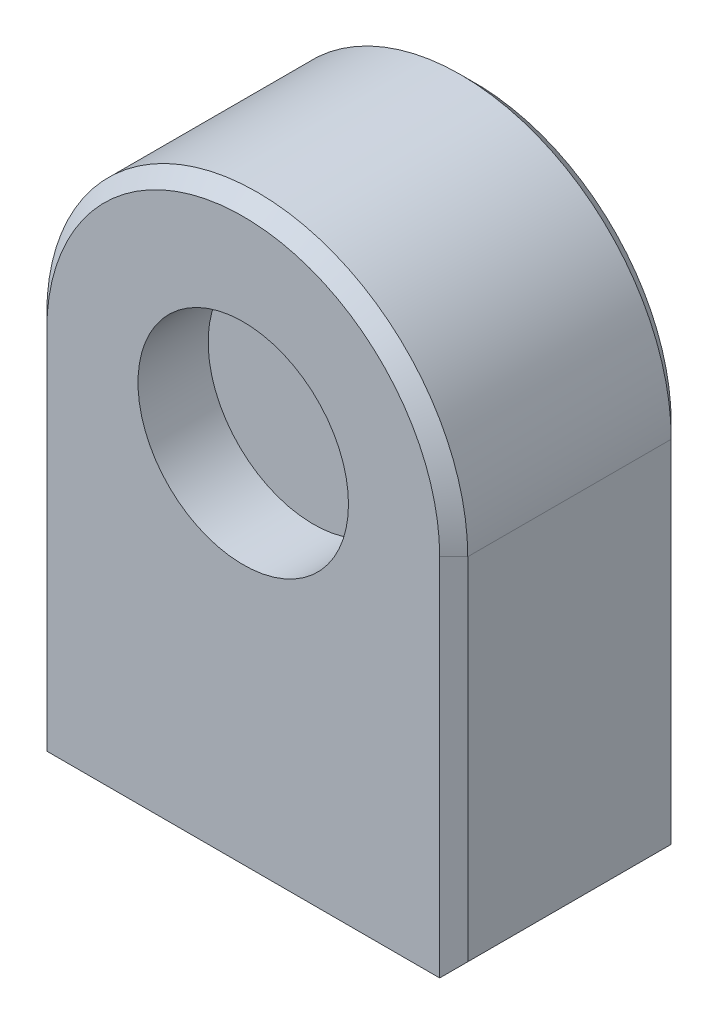
ISO-10303-21;
HEADER;
FILE_DESCRIPTION(('STEP AP214'),'2;1');
FILE_NAME('part.step','',(''),(''),'','','');
FILE_SCHEMA(('AUTOMOTIVE_DESIGN { 1 0 10303 214 1 1 1 1 }'));
ENDSEC;
DATA;
#1=APPLICATION_CONTEXT('core data for automotive mechanical design processes');
#2=APPLICATION_PROTOCOL_DEFINITION('international standard','automotive_design',2000,#1);
#3=PRODUCT_CONTEXT('',#1,'mechanical');
#4=PRODUCT('Part','Part','',(#3));
#5=PRODUCT_RELATED_PRODUCT_CATEGORY('part','',(#4));
#6=PRODUCT_DEFINITION_FORMATION('','',#4);
#7=PRODUCT_DEFINITION_CONTEXT('part definition',#1,'design');
#8=PRODUCT_DEFINITION('design','',#6,#7);
#9=PRODUCT_DEFINITION_SHAPE('','',#8);
#10=(LENGTH_UNIT() NAMED_UNIT(*) SI_UNIT(.MILLI.,.METRE.));
#11=(NAMED_UNIT(*) PLANE_ANGLE_UNIT() SI_UNIT($,.RADIAN.));
#12=(NAMED_UNIT(*) SI_UNIT($,.STERADIAN.) SOLID_ANGLE_UNIT());
#13=UNCERTAINTY_MEASURE_WITH_UNIT(LENGTH_MEASURE(1.E-05),#10,'distance_accuracy_value','');
#14=(GEOMETRIC_REPRESENTATION_CONTEXT(3) GLOBAL_UNCERTAINTY_ASSIGNED_CONTEXT((#13)) GLOBAL_UNIT_ASSIGNED_CONTEXT((#10,
#11,#12)) REPRESENTATION_CONTEXT('',''));
#15=CARTESIAN_POINT('',(0.,0.,0.));
#16=DIRECTION('',(0.,0.,1.));
#17=DIRECTION('',(1.,0.,0.));
#18=AXIS2_PLACEMENT_3D('',#15,#16,#17);
#19=CARTESIAN_POINT('',(0.,0.,16.5));
#20=DIRECTION('',(0.,0.,-1.));
#21=DIRECTION('',(-1.,0.,0.));
#22=AXIS2_PLACEMENT_3D('',#19,#20,#21);
#23=CYLINDRICAL_SURFACE('',#22,15.);
#24=DIRECTION('',(0.,0.,-1.));
#25=VECTOR('',#24,1.);
#26=CARTESIAN_POINT('',(-15.,0.,16.5));
#27=LINE('',#26,#25);
#28=CARTESIAN_POINT('',(-15.,0.,15.5));
#29=VERTEX_POINT('',#28);
#30=CARTESIAN_POINT('',(-15.,0.,1.));
#31=VERTEX_POINT('',#30);
#32=EDGE_CURVE('E115',#29,#31,#27,.T.);
#33=ORIENTED_EDGE('',*,*,#32,.F.);
#34=CARTESIAN_POINT('',(0.,0.,15.5));
#35=DIRECTION('',(0.,0.,-1.));
#36=DIRECTION('',(-1.,0.,0.));
#37=AXIS2_PLACEMENT_3D('',#34,#35,#36);
#38=CIRCLE('',#37,15.);
#39=CARTESIAN_POINT('',(15.,0.,15.5));
#40=VERTEX_POINT('',#39);
#41=EDGE_CURVE('E173',#29,#40,#38,.T.);
#42=ORIENTED_EDGE('',*,*,#41,.T.);
#43=DIRECTION('',(0.,0.,-1.));
#44=VECTOR('',#43,1.);
#45=CARTESIAN_POINT('',(15.,0.,16.5));
#46=LINE('',#45,#44);
#47=CARTESIAN_POINT('',(15.,0.,1.));
#48=VERTEX_POINT('',#47);
#49=EDGE_CURVE('E123',#40,#48,#46,.T.);
#50=ORIENTED_EDGE('',*,*,#49,.T.);
#51=CARTESIAN_POINT('',(0.,0.,1.));
#52=DIRECTION('',(0.,0.,-1.));
#53=DIRECTION('',(-1.,0.,0.));
#54=AXIS2_PLACEMENT_3D('',#51,#52,#53);
#55=CIRCLE('',#54,15.);
#56=EDGE_CURVE('E171',#48,#31,#55,.F.);
#57=ORIENTED_EDGE('',*,*,#56,.T.);
#58=EDGE_LOOP('',(#33,#42,#50,#57));
#59=FACE_BOUND('',#58,.T.);
#60=ADVANCED_FACE('F37',(#59),#23,.T.);
#61=CARTESIAN_POINT('',(-15.,0.,16.5));
#62=DIRECTION('',(1.,0.,0.));
#63=DIRECTION('',(0.,1.,0.));
#64=AXIS2_PLACEMENT_3D('',#61,#62,#63);
#65=PLANE('',#64);
#66=DIRECTION('',(0.,0.,1.));
#67=VECTOR('',#66,1.);
#68=CARTESIAN_POINT('',(-15.,-25.,16.5));
#69=LINE('',#68,#67);
#70=CARTESIAN_POINT('',(-15.,-25.,1.));
#71=VERTEX_POINT('',#70);
#72=CARTESIAN_POINT('',(-15.,-25.,15.5));
#73=VERTEX_POINT('',#72);
#74=EDGE_CURVE('E54',#71,#73,#69,.T.);
#75=ORIENTED_EDGE('',*,*,#74,.T.);
#76=DIRECTION('',(0.,1.,0.));
#77=VECTOR('',#76,1.);
#78=CARTESIAN_POINT('',(-15.,0.,15.5));
#79=LINE('',#78,#77);
#80=EDGE_CURVE('E133',#73,#29,#79,.T.);
#81=ORIENTED_EDGE('',*,*,#80,.T.);
#82=ORIENTED_EDGE('',*,*,#32,.T.);
#83=DIRECTION('',(0.,-1.,0.));
#84=VECTOR('',#83,1.);
#85=CARTESIAN_POINT('',(-15.,-26.,1.));
#86=LINE('',#85,#84);
#87=EDGE_CURVE('E59',#31,#71,#86,.T.);
#88=ORIENTED_EDGE('',*,*,#87,.T.);
#89=EDGE_LOOP('',(#75,#81,#82,#88));
#90=FACE_BOUND('',#89,.T.);
#91=ADVANCED_FACE('F205',(#90),#65,.F.);
#92=CARTESIAN_POINT('',(-15.,-26.,16.5));
#93=DIRECTION('',(0.,1.,0.));
#94=DIRECTION('',(0.,0.,1.));
#95=AXIS2_PLACEMENT_3D('',#92,#93,#94);
#96=PLANE('',#95);
#97=DIRECTION('',(1.,0.,0.));
#98=VECTOR('',#97,1.);
#99=CARTESIAN_POINT('',(-15.,-26.,16.5));
#100=LINE('',#99,#98);
#101=CARTESIAN_POINT('',(-14.,-26.,16.5));
#102=VERTEX_POINT('',#101);
#103=CARTESIAN_POINT('',(14.,-26.,16.5));
#104=VERTEX_POINT('',#103);
#105=EDGE_CURVE('E107',#102,#104,#100,.T.);
#106=ORIENTED_EDGE('',*,*,#105,.F.);
#107=DIRECTION('',(0.,0.,-1.));
#108=VECTOR('',#107,1.);
#109=CARTESIAN_POINT('',(-14.,-26.,16.5));
#110=LINE('',#109,#108);
#111=CARTESIAN_POINT('',(-14.,-26.,0.));
#112=VERTEX_POINT('',#111);
#113=EDGE_CURVE('E11',#102,#112,#110,.T.);
#114=ORIENTED_EDGE('',*,*,#113,.T.);
#115=DIRECTION('',(1.,0.,0.));
#116=VECTOR('',#115,1.);
#117=CARTESIAN_POINT('',(-15.,-26.,0.));
#118=LINE('',#117,#116);
#119=CARTESIAN_POINT('',(14.,-26.,0.));
#120=VERTEX_POINT('',#119);
#121=EDGE_CURVE('E124',#112,#120,#118,.T.);
#122=ORIENTED_EDGE('',*,*,#121,.T.);
#123=DIRECTION('',(0.,0.,1.));
#124=VECTOR('',#123,1.);
#125=CARTESIAN_POINT('',(14.,-26.,16.5));
#126=LINE('',#125,#124);
#127=EDGE_CURVE('E46',#120,#104,#126,.T.);
#128=ORIENTED_EDGE('',*,*,#127,.T.);
#129=EDGE_LOOP('',(#106,#114,#122,#128));
#130=FACE_BOUND('',#129,.T.);
#131=ADVANCED_FACE('F119',(#130),#96,.F.);
#132=CARTESIAN_POINT('',(15.,0.,16.5));
#133=DIRECTION('',(-1.,0.,0.));
#134=DIRECTION('',(0.,-1.,0.));
#135=AXIS2_PLACEMENT_3D('',#132,#133,#134);
#136=PLANE('',#135);
#137=ORIENTED_EDGE('',*,*,#49,.F.);
#138=DIRECTION('',(0.,-1.,0.));
#139=VECTOR('',#138,1.);
#140=CARTESIAN_POINT('',(15.,0.,15.5));
#141=LINE('',#140,#139);
#142=CARTESIAN_POINT('',(15.,-25.,15.5));
#143=VERTEX_POINT('',#142);
#144=EDGE_CURVE('E162',#40,#143,#141,.T.);
#145=ORIENTED_EDGE('',*,*,#144,.T.);
#146=DIRECTION('',(0.,0.,-1.));
#147=VECTOR('',#146,1.);
#148=CARTESIAN_POINT('',(15.,-25.,16.5));
#149=LINE('',#148,#147);
#150=CARTESIAN_POINT('',(15.,-25.,1.));
#151=VERTEX_POINT('',#150);
#152=EDGE_CURVE('E158',#143,#151,#149,.T.);
#153=ORIENTED_EDGE('',*,*,#152,.T.);
#154=DIRECTION('',(0.,1.,0.));
#155=VECTOR('',#154,1.);
#156=CARTESIAN_POINT('',(15.,0.,1.));
#157=LINE('',#156,#155);
#158=EDGE_CURVE('E160',#151,#48,#157,.T.);
#159=ORIENTED_EDGE('',*,*,#158,.T.);
#160=EDGE_LOOP('',(#137,#145,#153,#159));
#161=FACE_BOUND('',#160,.T.);
#162=ADVANCED_FACE('F192',(#161),#136,.F.);
#163=CARTESIAN_POINT('',(0.,0.,16.5));
#164=DIRECTION('',(0.,0.,-1.));
#165=DIRECTION('',(-1.,0.,0.));
#166=AXIS2_PLACEMENT_3D('',#163,#164,#165);
#167=PLANE('',#166);
#168=CARTESIAN_POINT('',(0.,0.,16.5));
#169=DIRECTION('',(0.,0.,1.));
#170=DIRECTION('',(1.,0.,0.));
#171=AXIS2_PLACEMENT_3D('',#168,#169,#170);
#172=CIRCLE('',#171,7.5);
#173=CARTESIAN_POINT('',(7.5,0.,16.5));
#174=VERTEX_POINT('',#173);
#175=EDGE_CURVE('E343',#174,#174,#172,.T.);
#176=ORIENTED_EDGE('',*,*,#175,.F.);
#177=EDGE_LOOP('',(#176));
#178=FACE_BOUND('',#177,.T.);
#179=ORIENTED_EDGE('',*,*,#105,.T.);
#180=DIRECTION('',(0.,1.,0.));
#181=VECTOR('',#180,1.);
#182=CARTESIAN_POINT('',(14.,0.,16.5));
#183=LINE('',#182,#181);
#184=CARTESIAN_POINT('',(14.,0.,16.5));
#185=VERTEX_POINT('',#184);
#186=EDGE_CURVE('E156',#104,#185,#183,.T.);
#187=ORIENTED_EDGE('',*,*,#186,.T.);
#188=CARTESIAN_POINT('',(0.,0.,16.5));
#189=DIRECTION('',(0.,0.,-1.));
#190=DIRECTION('',(-1.,0.,0.));
#191=AXIS2_PLACEMENT_3D('',#188,#189,#190);
#192=CIRCLE('',#191,14.);
#193=CARTESIAN_POINT('',(-14.,0.,16.5));
#194=VERTEX_POINT('',#193);
#195=EDGE_CURVE('E110',#185,#194,#192,.F.);
#196=ORIENTED_EDGE('',*,*,#195,.T.);
#197=DIRECTION('',(0.,-1.,0.));
#198=VECTOR('',#197,1.);
#199=CARTESIAN_POINT('',(-14.,0.,16.5));
#200=LINE('',#199,#198);
#201=EDGE_CURVE('E103',#194,#102,#200,.T.);
#202=ORIENTED_EDGE('',*,*,#201,.T.);
#203=EDGE_LOOP('',(#179,#187,#196,#202));
#204=FACE_BOUND('',#203,.T.);
#205=ADVANCED_FACE('F105',(#178,#204),#167,.F.);
#206=CARTESIAN_POINT('',(0.,0.,0.));
#207=DIRECTION('',(0.,0.,-1.));
#208=DIRECTION('',(-1.,0.,0.));
#209=AXIS2_PLACEMENT_3D('',#206,#207,#208);
#210=PLANE('',#209);
#211=CARTESIAN_POINT('',(0.,0.,0.));
#212=DIRECTION('',(0.,0.,-1.));
#213=DIRECTION('',(-1.,0.,0.));
#214=AXIS2_PLACEMENT_3D('',#211,#212,#213);
#215=CIRCLE('',#214,14.);
#216=CARTESIAN_POINT('',(-14.,0.,0.));
#217=VERTEX_POINT('',#216);
#218=CARTESIAN_POINT('',(14.,0.,0.));
#219=VERTEX_POINT('',#218);
#220=EDGE_CURVE('E167',#217,#219,#215,.T.);
#221=ORIENTED_EDGE('',*,*,#220,.T.);
#222=DIRECTION('',(0.,-1.,0.));
#223=VECTOR('',#222,1.);
#224=CARTESIAN_POINT('',(14.,-26.,0.));
#225=LINE('',#224,#223);
#226=EDGE_CURVE('E169',#219,#120,#225,.T.);
#227=ORIENTED_EDGE('',*,*,#226,.T.);
#228=ORIENTED_EDGE('',*,*,#121,.F.);
#229=DIRECTION('',(0.,1.,0.));
#230=VECTOR('',#229,1.);
#231=CARTESIAN_POINT('',(-14.,0.,0.));
#232=LINE('',#231,#230);
#233=EDGE_CURVE('E165',#112,#217,#232,.T.);
#234=ORIENTED_EDGE('',*,*,#233,.T.);
#235=EDGE_LOOP('',(#221,#227,#228,#234));
#236=FACE_BOUND('',#235,.T.);
#237=ADVANCED_FACE('F209',(#236),#210,.T.);
#238=CARTESIAN_POINT('',(-15.,0.,1.));
#239=DIRECTION('',(-0.707106781186547,0.,-0.707106781186547));
#240=DIRECTION('',(0.,1.,0.));
#241=AXIS2_PLACEMENT_3D('',#238,#239,#240);
#242=PLANE('',#241);
#243=DIRECTION('',(-0.577350269189626,0.577350269189626,0.577350269189626));
#244=VECTOR('',#243,1.);
#245=CARTESIAN_POINT('',(-19.5,-20.5,5.5));
#246=LINE('',#245,#244);
#247=EDGE_CURVE('E131',#71,#112,#246,.F.);
#248=ORIENTED_EDGE('',*,*,#247,.F.);
#249=ORIENTED_EDGE('',*,*,#87,.F.);
#250=DIRECTION('',(-0.707106781186547,0.,0.707106781186547));
#251=VECTOR('',#250,1.);
#252=CARTESIAN_POINT('',(-14.,0.,0.));
#253=LINE('',#252,#251);
#254=EDGE_CURVE('E41',#217,#31,#253,.T.);
#255=ORIENTED_EDGE('',*,*,#254,.F.);
#256=ORIENTED_EDGE('',*,*,#233,.F.);
#257=EDGE_LOOP('',(#248,#249,#255,#256));
#258=FACE_BOUND('',#257,.T.);
#259=ADVANCED_FACE('F39',(#258),#242,.T.);
#260=CARTESIAN_POINT('',(0.,0.,1.));
#261=DIRECTION('',(0.,0.,1.));
#262=DIRECTION('',(1.,0.,0.));
#263=AXIS2_PLACEMENT_3D('',#260,#261,#262);
#264=CONICAL_SURFACE('',#263,15.,0.785398163397448);
#265=ORIENTED_EDGE('',*,*,#254,.T.);
#266=ORIENTED_EDGE('',*,*,#56,.F.);
#267=DIRECTION('',(0.707106781186547,0.,0.707106781186547));
#268=VECTOR('',#267,1.);
#269=CARTESIAN_POINT('',(14.,0.,0.));
#270=LINE('',#269,#268);
#271=EDGE_CURVE('E134',#219,#48,#270,.T.);
#272=ORIENTED_EDGE('',*,*,#271,.F.);
#273=ORIENTED_EDGE('',*,*,#220,.F.);
#274=EDGE_LOOP('',(#265,#266,#272,#273));
#275=FACE_BOUND('',#274,.T.);
#276=ADVANCED_FACE('F204',(#275),#264,.T.);
#277=CARTESIAN_POINT('',(-14.,-26.,16.5));
#278=DIRECTION('',(0.707106781186547,0.707106781186547,0.));
#279=DIRECTION('',(0.,0.,-1.));
#280=AXIS2_PLACEMENT_3D('',#277,#278,#279);
#281=PLANE('',#280);
#282=ORIENTED_EDGE('',*,*,#247,.T.);
#283=ORIENTED_EDGE('',*,*,#113,.F.);
#284=DIRECTION('',(-0.577350269189626,0.577350269189626,-0.577350269189626));
#285=VECTOR('',#284,1.);
#286=CARTESIAN_POINT('',(-14.,-26.,16.5));
#287=LINE('',#286,#285);
#288=EDGE_CURVE('E129',#73,#102,#287,.F.);
#289=ORIENTED_EDGE('',*,*,#288,.F.);
#290=ORIENTED_EDGE('',*,*,#74,.F.);
#291=EDGE_LOOP('',(#282,#283,#289,#290));
#292=FACE_BOUND('',#291,.T.);
#293=ADVANCED_FACE('F128',(#292),#281,.F.);
#294=CARTESIAN_POINT('',(15.,0.,1.));
#295=DIRECTION('',(0.707106781186547,0.,-0.707106781186547));
#296=DIRECTION('',(0.,-1.,0.));
#297=AXIS2_PLACEMENT_3D('',#294,#295,#296);
#298=PLANE('',#297);
#299=ORIENTED_EDGE('',*,*,#271,.T.);
#300=ORIENTED_EDGE('',*,*,#158,.F.);
#301=DIRECTION('',(-0.577350269189627,-0.577350269189623,-0.577350269189627));
#302=VECTOR('',#301,1.);
#303=CARTESIAN_POINT('',(20.1666666666667,-19.8333333333334,6.16666666666669));
#304=LINE('',#303,#302);
#305=EDGE_CURVE('E135',#120,#151,#304,.F.);
#306=ORIENTED_EDGE('',*,*,#305,.F.);
#307=ORIENTED_EDGE('',*,*,#226,.F.);
#308=EDGE_LOOP('',(#299,#300,#306,#307));
#309=FACE_BOUND('',#308,.T.);
#310=ADVANCED_FACE('F201',(#309),#298,.T.);
#311=CARTESIAN_POINT('',(-14.,0.,16.5));
#312=DIRECTION('',(0.707106781186547,0.,-0.707106781186547));
#313=DIRECTION('',(0.,-1.,0.));
#314=AXIS2_PLACEMENT_3D('',#311,#312,#313);
#315=PLANE('',#314);
#316=ORIENTED_EDGE('',*,*,#288,.T.);
#317=ORIENTED_EDGE('',*,*,#201,.F.);
#318=DIRECTION('',(0.707106781186547,0.,0.707106781186547));
#319=VECTOR('',#318,1.);
#320=CARTESIAN_POINT('',(-15.,0.,15.5));
#321=LINE('',#320,#319);
#322=EDGE_CURVE('E140',#29,#194,#321,.T.);
#323=ORIENTED_EDGE('',*,*,#322,.F.);
#324=ORIENTED_EDGE('',*,*,#80,.F.);
#325=EDGE_LOOP('',(#316,#317,#323,#324));
#326=FACE_BOUND('',#325,.T.);
#327=ADVANCED_FACE('F132',(#326),#315,.F.);
#328=CARTESIAN_POINT('',(15.,-25.,16.5));
#329=DIRECTION('',(-0.707106781186545,0.70710678118655,0.));
#330=DIRECTION('',(0.,0.,-1.));
#331=AXIS2_PLACEMENT_3D('',#328,#329,#330);
#332=PLANE('',#331);
#333=ORIENTED_EDGE('',*,*,#305,.T.);
#334=ORIENTED_EDGE('',*,*,#152,.F.);
#335=DIRECTION('',(-0.577350269189627,-0.577350269189623,0.577350269189627));
#336=VECTOR('',#335,1.);
#337=CARTESIAN_POINT('',(14.6666666666667,-25.3333333333333,15.8333333333333));
#338=LINE('',#337,#336);
#339=EDGE_CURVE('E181',#104,#143,#338,.F.);
#340=ORIENTED_EDGE('',*,*,#339,.F.);
#341=ORIENTED_EDGE('',*,*,#127,.F.);
#342=EDGE_LOOP('',(#333,#334,#340,#341));
#343=FACE_BOUND('',#342,.T.);
#344=ADVANCED_FACE('F199',(#343),#332,.F.);
#345=CARTESIAN_POINT('',(0.,0.,16.5));
#346=DIRECTION('',(0.,0.,-1.));
#347=DIRECTION('',(-1.,0.,0.));
#348=AXIS2_PLACEMENT_3D('',#345,#346,#347);
#349=CONICAL_SURFACE('',#348,14.,0.785398163397448);
#350=ORIENTED_EDGE('',*,*,#322,.T.);
#351=ORIENTED_EDGE('',*,*,#195,.F.);
#352=DIRECTION('',(-0.707106781186547,0.,0.707106781186547));
#353=VECTOR('',#352,1.);
#354=CARTESIAN_POINT('',(15.,0.,15.5));
#355=LINE('',#354,#353);
#356=EDGE_CURVE('E179',#40,#185,#355,.T.);
#357=ORIENTED_EDGE('',*,*,#356,.F.);
#358=ORIENTED_EDGE('',*,*,#41,.F.);
#359=EDGE_LOOP('',(#350,#351,#357,#358));
#360=FACE_BOUND('',#359,.T.);
#361=ADVANCED_FACE('F185',(#360),#349,.T.);
#362=CARTESIAN_POINT('',(14.,0.,16.5));
#363=DIRECTION('',(-0.707106781186547,0.,-0.707106781186547));
#364=DIRECTION('',(0.,1.,0.));
#365=AXIS2_PLACEMENT_3D('',#362,#363,#364);
#366=PLANE('',#365);
#367=ORIENTED_EDGE('',*,*,#339,.T.);
#368=ORIENTED_EDGE('',*,*,#144,.F.);
#369=ORIENTED_EDGE('',*,*,#356,.T.);
#370=ORIENTED_EDGE('',*,*,#186,.F.);
#371=EDGE_LOOP('',(#367,#368,#369,#370));
#372=FACE_BOUND('',#371,.T.);
#373=ADVANCED_FACE('F195',(#372),#366,.F.);
#374=CARTESIAN_POINT('',(0.,0.,11.5));
#375=DIRECTION('',(0.,0.,1.));
#376=DIRECTION('',(1.,0.,0.));
#377=AXIS2_PLACEMENT_3D('',#374,#375,#376);
#378=CYLINDRICAL_SURFACE('',#377,7.5);
#379=CARTESIAN_POINT('',(0.,0.,11.5));
#380=DIRECTION('',(0.,0.,1.));
#381=DIRECTION('',(1.,0.,0.));
#382=AXIS2_PLACEMENT_3D('',#379,#380,#381);
#383=CIRCLE('',#382,7.5);
#384=CARTESIAN_POINT('',(7.5,0.,11.5));
#385=VERTEX_POINT('',#384);
#386=EDGE_CURVE('E182',#385,#385,#383,.T.);
#387=ORIENTED_EDGE('',*,*,#386,.F.);
#388=EDGE_LOOP('',(#387));
#389=FACE_BOUND('',#388,.T.);
#390=ORIENTED_EDGE('',*,*,#175,.T.);
#391=EDGE_LOOP('',(#390));
#392=FACE_BOUND('',#391,.T.);
#393=ADVANCED_FACE('F229',(#389,#392),#378,.F.);
#394=CARTESIAN_POINT('',(0.,0.,11.5));
#395=DIRECTION('',(0.,0.,1.));
#396=DIRECTION('',(1.,0.,0.));
#397=AXIS2_PLACEMENT_3D('',#394,#395,#396);
#398=PLANE('',#397);
#399=ORIENTED_EDGE('',*,*,#386,.T.);
#400=EDGE_LOOP('',(#399));
#401=FACE_BOUND('',#400,.T.);
#402=ADVANCED_FACE('F275',(#401),#398,.T.);
#403=CLOSED_SHELL('',(#60,#91,#131,#162,#205,#237,#259,#276,#293,#310,#327,#344,#361,#373,#393,#402));
#404=MANIFOLD_SOLID_BREP('B2',#403);
#405=ADVANCED_BREP_SHAPE_REPRESENTATION('',(#18,#404),#14);
#406=SHAPE_DEFINITION_REPRESENTATION(#9,#405);
ENDSEC;
END-ISO-10303-21;
